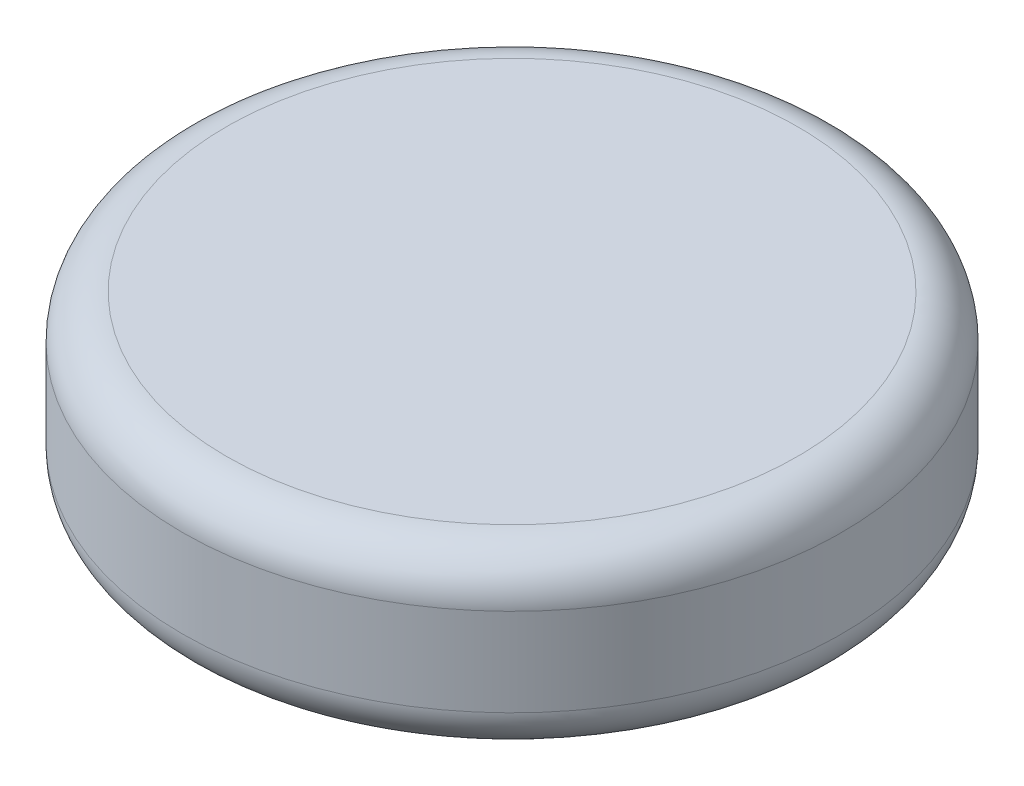
ISO-10303-21;
HEADER;
FILE_DESCRIPTION(('STEP AP214'),'2;1');
FILE_NAME('part.step','',(''),(''),'','','');
FILE_SCHEMA(('AUTOMOTIVE_DESIGN { 1 0 10303 214 1 1 1 1 }'));
ENDSEC;
DATA;
#1=APPLICATION_CONTEXT('core data for automotive mechanical design processes');
#2=APPLICATION_PROTOCOL_DEFINITION('international standard','automotive_design',2000,#1);
#3=PRODUCT_CONTEXT('',#1,'mechanical');
#4=PRODUCT('Part','Part','',(#3));
#5=PRODUCT_RELATED_PRODUCT_CATEGORY('part','',(#4));
#6=PRODUCT_DEFINITION_FORMATION('','',#4);
#7=PRODUCT_DEFINITION_CONTEXT('part definition',#1,'design');
#8=PRODUCT_DEFINITION('design','',#6,#7);
#9=PRODUCT_DEFINITION_SHAPE('','',#8);
#10=(LENGTH_UNIT() NAMED_UNIT(*) SI_UNIT(.MILLI.,.METRE.));
#11=(NAMED_UNIT(*) PLANE_ANGLE_UNIT() SI_UNIT($,.RADIAN.));
#12=(NAMED_UNIT(*) SI_UNIT($,.STERADIAN.) SOLID_ANGLE_UNIT());
#13=UNCERTAINTY_MEASURE_WITH_UNIT(LENGTH_MEASURE(1.E-05),#10,'distance_accuracy_value','');
#14=(GEOMETRIC_REPRESENTATION_CONTEXT(3) GLOBAL_UNCERTAINTY_ASSIGNED_CONTEXT((#13)) GLOBAL_UNIT_ASSIGNED_CONTEXT((#10,
#11,#12)) REPRESENTATION_CONTEXT('',''));
#15=CARTESIAN_POINT('',(0.,0.,0.));
#16=DIRECTION('',(0.,0.,1.));
#17=DIRECTION('',(1.,0.,0.));
#18=AXIS2_PLACEMENT_3D('',#15,#16,#17);
#19=CARTESIAN_POINT('',(0.,-1.2,0.));
#20=DIRECTION('',(0.,1.,0.));
#21=DIRECTION('',(0.,0.,1.));
#22=AXIS2_PLACEMENT_3D('',#19,#20,#21);
#23=PLANE('',#22);
#24=CARTESIAN_POINT('',(0.,-1.2,0.));
#25=DIRECTION('',(0.,1.,0.));
#26=DIRECTION('',(0.,0.,1.));
#27=AXIS2_PLACEMENT_3D('',#24,#25,#26);
#28=CIRCLE('',#27,6.3);
#29=CARTESIAN_POINT('',(0.,-1.2,6.3));
#30=VERTEX_POINT('',#29);
#31=EDGE_CURVE('E250',#30,#30,#28,.T.);
#32=ORIENTED_EDGE('',*,*,#31,.F.);
#33=EDGE_LOOP('',(#32));
#34=FACE_BOUND('',#33,.T.);
#35=DIRECTION('',(0.,0.,-1.));
#36=VECTOR('',#35,1.);
#37=CARTESIAN_POINT('',(-3.1,-1.2,0.));
#38=LINE('',#37,#36);
#39=CARTESIAN_POINT('',(-3.1,-1.2,3.1));
#40=VERTEX_POINT('',#39);
#41=CARTESIAN_POINT('',(-3.1,-1.2,-3.1));
#42=VERTEX_POINT('',#41);
#43=EDGE_CURVE('E260',#40,#42,#38,.T.);
#44=ORIENTED_EDGE('',*,*,#43,.F.);
#45=DIRECTION('',(-1.,0.,0.));
#46=VECTOR('',#45,1.);
#47=CARTESIAN_POINT('',(0.,-1.2,3.1));
#48=LINE('',#47,#46);
#49=CARTESIAN_POINT('',(3.1,-1.2,3.1));
#50=VERTEX_POINT('',#49);
#51=EDGE_CURVE('E253',#50,#40,#48,.T.);
#52=ORIENTED_EDGE('',*,*,#51,.F.);
#53=DIRECTION('',(0.,0.,-1.));
#54=VECTOR('',#53,1.);
#55=CARTESIAN_POINT('',(3.1,-1.2,0.));
#56=LINE('',#55,#54);
#57=CARTESIAN_POINT('',(3.1,-1.2,-3.1));
#58=VERTEX_POINT('',#57);
#59=EDGE_CURVE('E256',#50,#58,#56,.T.);
#60=ORIENTED_EDGE('',*,*,#59,.T.);
#61=DIRECTION('',(-1.,0.,0.));
#62=VECTOR('',#61,1.);
#63=CARTESIAN_POINT('',(0.,-1.2,-3.1));
#64=LINE('',#63,#62);
#65=EDGE_CURVE('E258',#58,#42,#64,.T.);
#66=ORIENTED_EDGE('',*,*,#65,.T.);
#67=EDGE_LOOP('',(#44,#52,#60,#66));
#68=FACE_BOUND('',#67,.T.);
#69=ADVANCED_FACE('F63',(#34,#68),#23,.F.);
#70=CARTESIAN_POINT('',(0.,-1.2,0.));
#71=DIRECTION('',(0.,1.,0.));
#72=DIRECTION('',(0.,0.,1.));
#73=AXIS2_PLACEMENT_3D('',#70,#71,#72);
#74=CYLINDRICAL_SURFACE('',#73,7.5);
#75=CARTESIAN_POINT('',(0.,-3.,0.));
#76=DIRECTION('',(0.,1.,0.));
#77=DIRECTION('',(0.,0.,1.));
#78=AXIS2_PLACEMENT_3D('',#75,#76,#77);
#79=CIRCLE('',#78,7.5);
#80=CARTESIAN_POINT('',(0.,-3.,7.5));
#81=VERTEX_POINT('',#80);
#82=EDGE_CURVE('E266',#81,#81,#79,.T.);
#83=ORIENTED_EDGE('',*,*,#82,.T.);
#84=EDGE_LOOP('',(#83));
#85=FACE_BOUND('',#84,.T.);
#86=CARTESIAN_POINT('',(0.,-1.,0.));
#87=DIRECTION('',(0.,1.,0.));
#88=DIRECTION('',(0.,0.,1.));
#89=AXIS2_PLACEMENT_3D('',#86,#87,#88);
#90=CIRCLE('',#89,7.5);
#91=CARTESIAN_POINT('',(0.,-1.,7.5));
#92=VERTEX_POINT('',#91);
#93=EDGE_CURVE('E263',#92,#92,#90,.F.);
#94=ORIENTED_EDGE('',*,*,#93,.T.);
#95=EDGE_LOOP('',(#94));
#96=FACE_BOUND('',#95,.T.);
#97=ADVANCED_FACE('F280',(#85,#96),#74,.T.);
#98=CARTESIAN_POINT('',(0.,0.,0.));
#99=DIRECTION('',(0.,1.,0.));
#100=DIRECTION('',(0.,0.,1.));
#101=AXIS2_PLACEMENT_3D('',#98,#99,#100);
#102=PLANE('',#101);
#103=CARTESIAN_POINT('',(0.,0.,0.));
#104=DIRECTION('',(0.,1.,0.));
#105=DIRECTION('',(0.,0.,1.));
#106=AXIS2_PLACEMENT_3D('',#103,#104,#105);
#107=CIRCLE('',#106,6.5);
#108=CARTESIAN_POINT('',(0.,0.,6.5));
#109=VERTEX_POINT('',#108);
#110=EDGE_CURVE('E12',#109,#109,#107,.T.);
#111=ORIENTED_EDGE('',*,*,#110,.T.);
#112=EDGE_LOOP('',(#111));
#113=FACE_BOUND('',#112,.T.);
#114=ADVANCED_FACE('F283',(#113),#102,.T.);
#115=CARTESIAN_POINT('',(0.,-4.,0.));
#116=DIRECTION('',(0.,1.,0.));
#117=DIRECTION('',(0.,0.,1.));
#118=AXIS2_PLACEMENT_3D('',#115,#116,#117);
#119=CYLINDRICAL_SURFACE('',#118,6.3);
#120=CARTESIAN_POINT('',(0.,-4.,0.));
#121=DIRECTION('',(0.,1.,0.));
#122=DIRECTION('',(0.,0.,1.));
#123=AXIS2_PLACEMENT_3D('',#120,#121,#122);
#124=CIRCLE('',#123,6.3);
#125=CARTESIAN_POINT('',(0.,-4.,6.3));
#126=VERTEX_POINT('',#125);
#127=EDGE_CURVE('E239',#126,#126,#124,.T.);
#128=ORIENTED_EDGE('',*,*,#127,.F.);
#129=EDGE_LOOP('',(#128));
#130=FACE_BOUND('',#129,.T.);
#131=ORIENTED_EDGE('',*,*,#31,.T.);
#132=EDGE_LOOP('',(#131));
#133=FACE_BOUND('',#132,.T.);
#134=ADVANCED_FACE('F292',(#130,#133),#119,.F.);
#135=CARTESIAN_POINT('',(0.,-4.,0.));
#136=DIRECTION('',(0.,1.,0.));
#137=DIRECTION('',(0.,0.,1.));
#138=AXIS2_PLACEMENT_3D('',#135,#136,#137);
#139=PLANE('',#138);
#140=CARTESIAN_POINT('',(0.,-4.,0.));
#141=DIRECTION('',(0.,1.,0.));
#142=DIRECTION('',(0.,0.,1.));
#143=AXIS2_PLACEMENT_3D('',#140,#141,#142);
#144=CIRCLE('',#143,6.5);
#145=CARTESIAN_POINT('',(0.,-4.,6.5));
#146=VERTEX_POINT('',#145);
#147=EDGE_CURVE('E71',#146,#146,#144,.F.);
#148=ORIENTED_EDGE('',*,*,#147,.T.);
#149=EDGE_LOOP('',(#148));
#150=FACE_BOUND('',#149,.T.);
#151=ORIENTED_EDGE('',*,*,#127,.T.);
#152=EDGE_LOOP('',(#151));
#153=FACE_BOUND('',#152,.T.);
#154=ADVANCED_FACE('F271',(#150,#153),#139,.F.);
#155=CARTESIAN_POINT('',(-3.1,-2.,0.));
#156=DIRECTION('',(1.,0.,0.));
#157=DIRECTION('',(0.,0.,-1.));
#158=AXIS2_PLACEMENT_3D('',#155,#156,#157);
#159=PLANE('',#158);
#160=DIRECTION('',(0.,1.,0.));
#161=VECTOR('',#160,1.);
#162=CARTESIAN_POINT('',(-3.1,-2.,3.1));
#163=LINE('',#162,#161);
#164=CARTESIAN_POINT('',(-3.1,-5.,3.1));
#165=VERTEX_POINT('',#164);
#166=EDGE_CURVE('E235',#165,#40,#163,.T.);
#167=ORIENTED_EDGE('',*,*,#166,.T.);
#168=ORIENTED_EDGE('',*,*,#43,.T.);
#169=DIRECTION('',(0.,1.,0.));
#170=VECTOR('',#169,1.);
#171=CARTESIAN_POINT('',(-3.1,-2.,-3.1));
#172=LINE('',#171,#170);
#173=CARTESIAN_POINT('',(-3.1,-5.,-3.1));
#174=VERTEX_POINT('',#173);
#175=EDGE_CURVE('E236',#174,#42,#172,.T.);
#176=ORIENTED_EDGE('',*,*,#175,.F.);
#177=DIRECTION('',(0.,0.,-1.));
#178=VECTOR('',#177,1.);
#179=CARTESIAN_POINT('',(-3.1,-5.,0.));
#180=LINE('',#179,#178);
#181=EDGE_CURVE('E226',#165,#174,#180,.T.);
#182=ORIENTED_EDGE('',*,*,#181,.F.);
#183=EDGE_LOOP('',(#167,#168,#176,#182));
#184=FACE_BOUND('',#183,.T.);
#185=ADVANCED_FACE('F309',(#184),#159,.F.);
#186=CARTESIAN_POINT('',(0.,-2.,-3.1));
#187=DIRECTION('',(0.,0.,-1.));
#188=DIRECTION('',(-1.,0.,0.));
#189=AXIS2_PLACEMENT_3D('',#186,#187,#188);
#190=PLANE('',#189);
#191=ORIENTED_EDGE('',*,*,#65,.F.);
#192=DIRECTION('',(0.,1.,0.));
#193=VECTOR('',#192,1.);
#194=CARTESIAN_POINT('',(3.1,-2.,-3.1));
#195=LINE('',#194,#193);
#196=CARTESIAN_POINT('',(3.1,-5.,-3.1));
#197=VERTEX_POINT('',#196);
#198=EDGE_CURVE('E240',#197,#58,#195,.T.);
#199=ORIENTED_EDGE('',*,*,#198,.F.);
#200=DIRECTION('',(-1.,0.,0.));
#201=VECTOR('',#200,1.);
#202=CARTESIAN_POINT('',(0.,-5.,-3.1));
#203=LINE('',#202,#201);
#204=EDGE_CURVE('E218',#197,#174,#203,.T.);
#205=ORIENTED_EDGE('',*,*,#204,.T.);
#206=ORIENTED_EDGE('',*,*,#175,.T.);
#207=EDGE_LOOP('',(#191,#199,#205,#206));
#208=FACE_BOUND('',#207,.T.);
#209=ADVANCED_FACE('F312',(#208),#190,.T.);
#210=CARTESIAN_POINT('',(3.1,-2.,0.));
#211=DIRECTION('',(1.,0.,0.));
#212=DIRECTION('',(0.,0.,-1.));
#213=AXIS2_PLACEMENT_3D('',#210,#211,#212);
#214=PLANE('',#213);
#215=ORIENTED_EDGE('',*,*,#59,.F.);
#216=DIRECTION('',(0.,1.,0.));
#217=VECTOR('',#216,1.);
#218=CARTESIAN_POINT('',(3.1,-2.,3.1));
#219=LINE('',#218,#217);
#220=CARTESIAN_POINT('',(3.1,-5.,3.1));
#221=VERTEX_POINT('',#220);
#222=EDGE_CURVE('E243',#221,#50,#219,.T.);
#223=ORIENTED_EDGE('',*,*,#222,.F.);
#224=DIRECTION('',(0.,0.,-1.));
#225=VECTOR('',#224,1.);
#226=CARTESIAN_POINT('',(3.1,-5.,0.));
#227=LINE('',#226,#225);
#228=EDGE_CURVE('E232',#221,#197,#227,.T.);
#229=ORIENTED_EDGE('',*,*,#228,.T.);
#230=ORIENTED_EDGE('',*,*,#198,.T.);
#231=EDGE_LOOP('',(#215,#223,#229,#230));
#232=FACE_BOUND('',#231,.T.);
#233=ADVANCED_FACE('F317',(#232),#214,.T.);
#234=CARTESIAN_POINT('',(0.,-2.,3.1));
#235=DIRECTION('',(0.,0.,-1.));
#236=DIRECTION('',(-1.,0.,0.));
#237=AXIS2_PLACEMENT_3D('',#234,#235,#236);
#238=PLANE('',#237);
#239=ORIENTED_EDGE('',*,*,#222,.T.);
#240=ORIENTED_EDGE('',*,*,#51,.T.);
#241=ORIENTED_EDGE('',*,*,#166,.F.);
#242=DIRECTION('',(-1.,0.,0.));
#243=VECTOR('',#242,1.);
#244=CARTESIAN_POINT('',(0.,-5.,3.1));
#245=LINE('',#244,#243);
#246=EDGE_CURVE('E229',#221,#165,#245,.T.);
#247=ORIENTED_EDGE('',*,*,#246,.F.);
#248=EDGE_LOOP('',(#239,#240,#241,#247));
#249=FACE_BOUND('',#248,.T.);
#250=ADVANCED_FACE('F314',(#249),#238,.F.);
#251=CARTESIAN_POINT('',(0.,-5.,0.));
#252=DIRECTION('',(0.,-1.,0.));
#253=DIRECTION('',(0.,0.,-1.));
#254=AXIS2_PLACEMENT_3D('',#251,#252,#253);
#255=PLANE('',#254);
#256=ORIENTED_EDGE('',*,*,#204,.F.);
#257=ORIENTED_EDGE('',*,*,#228,.F.);
#258=ORIENTED_EDGE('',*,*,#246,.T.);
#259=ORIENTED_EDGE('',*,*,#181,.T.);
#260=EDGE_LOOP('',(#256,#257,#258,#259));
#261=FACE_BOUND('',#260,.T.);
#262=DIRECTION('',(0.,0.,-1.));
#263=VECTOR('',#262,1.);
#264=CARTESIAN_POINT('',(-1.7,-5.,-1.7));
#265=LINE('',#264,#263);
#266=CARTESIAN_POINT('',(-1.7,-5.,1.7));
#267=VERTEX_POINT('',#266);
#268=CARTESIAN_POINT('',(-1.7,-5.,-1.7));
#269=VERTEX_POINT('',#268);
#270=EDGE_CURVE('E160',#267,#269,#265,.T.);
#271=ORIENTED_EDGE('',*,*,#270,.F.);
#272=DIRECTION('',(-1.,0.,0.));
#273=VECTOR('',#272,1.);
#274=CARTESIAN_POINT('',(1.7,-5.,1.7));
#275=LINE('',#274,#273);
#276=CARTESIAN_POINT('',(1.7,-5.,1.7));
#277=VERTEX_POINT('',#276);
#278=EDGE_CURVE('E178',#277,#267,#275,.T.);
#279=ORIENTED_EDGE('',*,*,#278,.F.);
#280=DIRECTION('',(0.,0.,1.));
#281=VECTOR('',#280,1.);
#282=CARTESIAN_POINT('',(1.7,-5.,-1.7));
#283=LINE('',#282,#281);
#284=CARTESIAN_POINT('',(1.7,-5.,-1.7));
#285=VERTEX_POINT('',#284);
#286=EDGE_CURVE('E181',#285,#277,#283,.T.);
#287=ORIENTED_EDGE('',*,*,#286,.F.);
#288=DIRECTION('',(1.,0.,0.));
#289=VECTOR('',#288,1.);
#290=CARTESIAN_POINT('',(1.7,-5.,-1.7));
#291=LINE('',#290,#289);
#292=EDGE_CURVE('E187',#269,#285,#291,.T.);
#293=ORIENTED_EDGE('',*,*,#292,.F.);
#294=EDGE_LOOP('',(#271,#279,#287,#293));
#295=FACE_BOUND('',#294,.T.);
#296=ADVANCED_FACE('F277',(#261,#295),#255,.T.);
#297=CARTESIAN_POINT('',(0.,-3.,0.));
#298=DIRECTION('',(0.,1.,0.));
#299=DIRECTION('',(0.,0.,1.));
#300=AXIS2_PLACEMENT_3D('',#297,#298,#299);
#301=TOROIDAL_SURFACE('',#300,6.5,1.);
#302=ORIENTED_EDGE('',*,*,#147,.F.);
#303=EDGE_LOOP('',(#302));
#304=FACE_BOUND('',#303,.T.);
#305=ORIENTED_EDGE('',*,*,#82,.F.);
#306=EDGE_LOOP('',(#305));
#307=FACE_BOUND('',#306,.T.);
#308=ADVANCED_FACE('F274',(#304,#307),#301,.T.);
#309=CARTESIAN_POINT('',(0.,-1.,0.));
#310=DIRECTION('',(0.,1.,0.));
#311=DIRECTION('',(0.,0.,1.));
#312=AXIS2_PLACEMENT_3D('',#309,#310,#311);
#313=TOROIDAL_SURFACE('',#312,6.5,1.);
#314=ORIENTED_EDGE('',*,*,#93,.F.);
#315=EDGE_LOOP('',(#314));
#316=FACE_BOUND('',#315,.T.);
#317=ORIENTED_EDGE('',*,*,#110,.F.);
#318=EDGE_LOOP('',(#317));
#319=FACE_BOUND('',#318,.T.);
#320=ADVANCED_FACE('F65',(#316,#319),#313,.T.);
#321=CARTESIAN_POINT('',(0.,-4.2,0.));
#322=DIRECTION('',(0.,-1.,0.));
#323=DIRECTION('',(0.,0.,-1.));
#324=AXIS2_PLACEMENT_3D('',#321,#322,#323);
#325=PLANE('',#324);
#326=DIRECTION('',(-1.,0.,0.));
#327=VECTOR('',#326,1.);
#328=CARTESIAN_POINT('',(1.7,-4.2,1.7));
#329=LINE('',#328,#327);
#330=CARTESIAN_POINT('',(1.7,-4.2,1.7));
#331=VERTEX_POINT('',#330);
#332=CARTESIAN_POINT('',(-1.7,-4.2,1.7));
#333=VERTEX_POINT('',#332);
#334=EDGE_CURVE('E165',#331,#333,#329,.T.);
#335=ORIENTED_EDGE('',*,*,#334,.T.);
#336=DIRECTION('',(0.,0.,-1.));
#337=VECTOR('',#336,1.);
#338=CARTESIAN_POINT('',(-1.7,-4.2,-1.7));
#339=LINE('',#338,#337);
#340=CARTESIAN_POINT('',(-1.7,-4.2,-1.7));
#341=VERTEX_POINT('',#340);
#342=EDGE_CURVE('E157',#333,#341,#339,.T.);
#343=ORIENTED_EDGE('',*,*,#342,.T.);
#344=DIRECTION('',(1.,0.,0.));
#345=VECTOR('',#344,1.);
#346=CARTESIAN_POINT('',(1.7,-4.2,-1.7));
#347=LINE('',#346,#345);
#348=CARTESIAN_POINT('',(1.7,-4.2,-1.7));
#349=VERTEX_POINT('',#348);
#350=EDGE_CURVE('E169',#341,#349,#347,.T.);
#351=ORIENTED_EDGE('',*,*,#350,.T.);
#352=DIRECTION('',(0.,0.,1.));
#353=VECTOR('',#352,1.);
#354=CARTESIAN_POINT('',(1.7,-4.2,-1.7));
#355=LINE('',#354,#353);
#356=EDGE_CURVE('E173',#349,#331,#355,.T.);
#357=ORIENTED_EDGE('',*,*,#356,.T.);
#358=EDGE_LOOP('',(#335,#343,#351,#357));
#359=FACE_BOUND('',#358,.T.);
#360=DIRECTION('',(0.,0.,-1.));
#361=VECTOR('',#360,1.);
#362=CARTESIAN_POINT('',(-1.9,-4.2,-1.9));
#363=LINE('',#362,#361);
#364=CARTESIAN_POINT('',(-1.9,-4.2,1.9));
#365=VERTEX_POINT('',#364);
#366=CARTESIAN_POINT('',(-1.9,-4.2,-1.9));
#367=VERTEX_POINT('',#366);
#368=EDGE_CURVE('E193',#365,#367,#363,.T.);
#369=ORIENTED_EDGE('',*,*,#368,.F.);
#370=DIRECTION('',(-1.,0.,0.));
#371=VECTOR('',#370,1.);
#372=CARTESIAN_POINT('',(1.9,-4.2,1.9));
#373=LINE('',#372,#371);
#374=CARTESIAN_POINT('',(1.9,-4.2,1.9));
#375=VERTEX_POINT('',#374);
#376=EDGE_CURVE('E85',#375,#365,#373,.T.);
#377=ORIENTED_EDGE('',*,*,#376,.F.);
#378=DIRECTION('',(0.,0.,1.));
#379=VECTOR('',#378,1.);
#380=CARTESIAN_POINT('',(1.9,-4.2,-1.9));
#381=LINE('',#380,#379);
#382=CARTESIAN_POINT('',(1.9,-4.2,-1.9));
#383=VERTEX_POINT('',#382);
#384=EDGE_CURVE('E78',#383,#375,#381,.T.);
#385=ORIENTED_EDGE('',*,*,#384,.F.);
#386=DIRECTION('',(1.,0.,0.));
#387=VECTOR('',#386,1.);
#388=CARTESIAN_POINT('',(1.9,-4.2,-1.9));
#389=LINE('',#388,#387);
#390=EDGE_CURVE('E199',#367,#383,#389,.T.);
#391=ORIENTED_EDGE('',*,*,#390,.F.);
#392=EDGE_LOOP('',(#369,#377,#385,#391));
#393=FACE_BOUND('',#392,.T.);
#394=ADVANCED_FACE('F175',(#359,#393),#325,.F.);
#395=CARTESIAN_POINT('',(-1.7,-4.2,-1.7));
#396=DIRECTION('',(-1.,0.,0.));
#397=DIRECTION('',(0.,0.,1.));
#398=AXIS2_PLACEMENT_3D('',#395,#396,#397);
#399=PLANE('',#398);
#400=ORIENTED_EDGE('',*,*,#270,.T.);
#401=DIRECTION('',(0.,-1.,0.));
#402=VECTOR('',#401,1.);
#403=CARTESIAN_POINT('',(-1.7,-4.2,-1.7));
#404=LINE('',#403,#402);
#405=EDGE_CURVE('E153',#341,#269,#404,.T.);
#406=ORIENTED_EDGE('',*,*,#405,.F.);
#407=ORIENTED_EDGE('',*,*,#342,.F.);
#408=DIRECTION('',(0.,-1.,0.));
#409=VECTOR('',#408,1.);
#410=CARTESIAN_POINT('',(-1.7,-4.2,1.7));
#411=LINE('',#410,#409);
#412=EDGE_CURVE('E191',#333,#267,#411,.T.);
#413=ORIENTED_EDGE('',*,*,#412,.T.);
#414=EDGE_LOOP('',(#400,#406,#407,#413));
#415=FACE_BOUND('',#414,.T.);
#416=ADVANCED_FACE('F155',(#415),#399,.F.);
#417=CARTESIAN_POINT('',(1.7,-4.2,1.7));
#418=DIRECTION('',(0.,0.,1.));
#419=DIRECTION('',(1.,0.,0.));
#420=AXIS2_PLACEMENT_3D('',#417,#418,#419);
#421=PLANE('',#420);
#422=ORIENTED_EDGE('',*,*,#278,.T.);
#423=ORIENTED_EDGE('',*,*,#412,.F.);
#424=ORIENTED_EDGE('',*,*,#334,.F.);
#425=DIRECTION('',(0.,-1.,0.));
#426=VECTOR('',#425,1.);
#427=CARTESIAN_POINT('',(1.7,-4.2,1.7));
#428=LINE('',#427,#426);
#429=EDGE_CURVE('E194',#331,#277,#428,.T.);
#430=ORIENTED_EDGE('',*,*,#429,.T.);
#431=EDGE_LOOP('',(#422,#423,#424,#430));
#432=FACE_BOUND('',#431,.T.);
#433=ADVANCED_FACE('F350',(#432),#421,.F.);
#434=CARTESIAN_POINT('',(1.7,-4.2,-1.7));
#435=DIRECTION('',(1.,0.,0.));
#436=DIRECTION('',(0.,0.,-1.));
#437=AXIS2_PLACEMENT_3D('',#434,#435,#436);
#438=PLANE('',#437);
#439=ORIENTED_EDGE('',*,*,#286,.T.);
#440=ORIENTED_EDGE('',*,*,#429,.F.);
#441=ORIENTED_EDGE('',*,*,#356,.F.);
#442=DIRECTION('',(0.,-1.,0.));
#443=VECTOR('',#442,1.);
#444=CARTESIAN_POINT('',(1.7,-4.2,-1.7));
#445=LINE('',#444,#443);
#446=EDGE_CURVE('E164',#349,#285,#445,.T.);
#447=ORIENTED_EDGE('',*,*,#446,.T.);
#448=EDGE_LOOP('',(#439,#440,#441,#447));
#449=FACE_BOUND('',#448,.T.);
#450=ADVANCED_FACE('F353',(#449),#438,.F.);
#451=CARTESIAN_POINT('',(1.7,-4.2,-1.7));
#452=DIRECTION('',(0.,0.,-1.));
#453=DIRECTION('',(-1.,0.,0.));
#454=AXIS2_PLACEMENT_3D('',#451,#452,#453);
#455=PLANE('',#454);
#456=ORIENTED_EDGE('',*,*,#292,.T.);
#457=ORIENTED_EDGE('',*,*,#446,.F.);
#458=ORIENTED_EDGE('',*,*,#350,.F.);
#459=ORIENTED_EDGE('',*,*,#405,.T.);
#460=EDGE_LOOP('',(#456,#457,#458,#459));
#461=FACE_BOUND('',#460,.T.);
#462=ADVANCED_FACE('F170',(#461),#455,.F.);
#463=CARTESIAN_POINT('',(0.,-2.,0.));
#464=DIRECTION('',(0.,1.,0.));
#465=DIRECTION('',(0.,0.,1.));
#466=AXIS2_PLACEMENT_3D('',#463,#464,#465);
#467=PLANE('',#466);
#468=DIRECTION('',(0.,0.,-1.));
#469=VECTOR('',#468,1.);
#470=CARTESIAN_POINT('',(1.9,-2.,0.));
#471=LINE('',#470,#469);
#472=CARTESIAN_POINT('',(1.9,-2.,1.9));
#473=VERTEX_POINT('',#472);
#474=CARTESIAN_POINT('',(1.9,-2.,-1.9));
#475=VERTEX_POINT('',#474);
#476=EDGE_CURVE('E203',#473,#475,#471,.T.);
#477=ORIENTED_EDGE('',*,*,#476,.F.);
#478=DIRECTION('',(-1.,0.,0.));
#479=VECTOR('',#478,1.);
#480=CARTESIAN_POINT('',(0.,-2.,1.9));
#481=LINE('',#480,#479);
#482=CARTESIAN_POINT('',(-1.9,-2.,1.9));
#483=VERTEX_POINT('',#482);
#484=EDGE_CURVE('E212',#473,#483,#481,.T.);
#485=ORIENTED_EDGE('',*,*,#484,.T.);
#486=DIRECTION('',(0.,0.,-1.));
#487=VECTOR('',#486,1.);
#488=CARTESIAN_POINT('',(-1.9,-2.,0.));
#489=LINE('',#488,#487);
#490=CARTESIAN_POINT('',(-1.9,-2.,-1.9));
#491=VERTEX_POINT('',#490);
#492=EDGE_CURVE('E209',#483,#491,#489,.T.);
#493=ORIENTED_EDGE('',*,*,#492,.T.);
#494=DIRECTION('',(-1.,0.,0.));
#495=VECTOR('',#494,1.);
#496=CARTESIAN_POINT('',(0.,-2.,-1.9));
#497=LINE('',#496,#495);
#498=EDGE_CURVE('E206',#475,#491,#497,.T.);
#499=ORIENTED_EDGE('',*,*,#498,.F.);
#500=EDGE_LOOP('',(#477,#485,#493,#499));
#501=FACE_BOUND('',#500,.T.);
#502=ADVANCED_FACE('F325',(#501),#467,.F.);
#503=CARTESIAN_POINT('',(0.,-5.,-1.9));
#504=DIRECTION('',(0.,0.,-1.));
#505=DIRECTION('',(-1.,0.,0.));
#506=AXIS2_PLACEMENT_3D('',#503,#504,#505);
#507=PLANE('',#506);
#508=ORIENTED_EDGE('',*,*,#390,.T.);
#509=DIRECTION('',(0.,1.,0.));
#510=VECTOR('',#509,1.);
#511=CARTESIAN_POINT('',(1.9,-5.,-1.9));
#512=LINE('',#511,#510);
#513=EDGE_CURVE('E215',#383,#475,#512,.T.);
#514=ORIENTED_EDGE('',*,*,#513,.T.);
#515=ORIENTED_EDGE('',*,*,#498,.T.);
#516=DIRECTION('',(0.,1.,0.));
#517=VECTOR('',#516,1.);
#518=CARTESIAN_POINT('',(-1.9,-5.,-1.9));
#519=LINE('',#518,#517);
#520=EDGE_CURVE('E221',#367,#491,#519,.T.);
#521=ORIENTED_EDGE('',*,*,#520,.F.);
#522=EDGE_LOOP('',(#508,#514,#515,#521));
#523=FACE_BOUND('',#522,.T.);
#524=ADVANCED_FACE('F328',(#523),#507,.F.);
#525=CARTESIAN_POINT('',(-1.9,-5.,0.));
#526=DIRECTION('',(1.,0.,0.));
#527=DIRECTION('',(0.,0.,-1.));
#528=AXIS2_PLACEMENT_3D('',#525,#526,#527);
#529=PLANE('',#528);
#530=DIRECTION('',(0.,1.,0.));
#531=VECTOR('',#530,1.);
#532=CARTESIAN_POINT('',(-1.9,-5.,1.9));
#533=LINE('',#532,#531);
#534=EDGE_CURVE('E219',#365,#483,#533,.T.);
#535=ORIENTED_EDGE('',*,*,#534,.F.);
#536=ORIENTED_EDGE('',*,*,#368,.T.);
#537=ORIENTED_EDGE('',*,*,#520,.T.);
#538=ORIENTED_EDGE('',*,*,#492,.F.);
#539=EDGE_LOOP('',(#535,#536,#537,#538));
#540=FACE_BOUND('',#539,.T.);
#541=ADVANCED_FACE('F339',(#540),#529,.T.);
#542=CARTESIAN_POINT('',(0.,-5.,1.9));
#543=DIRECTION('',(0.,0.,-1.));
#544=DIRECTION('',(-1.,0.,0.));
#545=AXIS2_PLACEMENT_3D('',#542,#543,#544);
#546=PLANE('',#545);
#547=DIRECTION('',(0.,1.,0.));
#548=VECTOR('',#547,1.);
#549=CARTESIAN_POINT('',(1.9,-5.,1.9));
#550=LINE('',#549,#548);
#551=EDGE_CURVE('E216',#375,#473,#550,.T.);
#552=ORIENTED_EDGE('',*,*,#551,.F.);
#553=ORIENTED_EDGE('',*,*,#376,.T.);
#554=ORIENTED_EDGE('',*,*,#534,.T.);
#555=ORIENTED_EDGE('',*,*,#484,.F.);
#556=EDGE_LOOP('',(#552,#553,#554,#555));
#557=FACE_BOUND('',#556,.T.);
#558=ADVANCED_FACE('F336',(#557),#546,.T.);
#559=CARTESIAN_POINT('',(1.9,-5.,0.));
#560=DIRECTION('',(1.,0.,0.));
#561=DIRECTION('',(0.,0.,-1.));
#562=AXIS2_PLACEMENT_3D('',#559,#560,#561);
#563=PLANE('',#562);
#564=ORIENTED_EDGE('',*,*,#384,.T.);
#565=ORIENTED_EDGE('',*,*,#551,.T.);
#566=ORIENTED_EDGE('',*,*,#476,.T.);
#567=ORIENTED_EDGE('',*,*,#513,.F.);
#568=EDGE_LOOP('',(#564,#565,#566,#567));
#569=FACE_BOUND('',#568,.T.);
#570=ADVANCED_FACE('F333',(#569),#563,.F.);
#571=CLOSED_SHELL('',(#69,#97,#114,#134,#154,#185,#209,#233,#250,#296,#308,#320,#394,#416,#433,
#450,#462,#502,#524,#541,#558,#570));
#572=MANIFOLD_SOLID_BREP('B2',#571);
#573=ADVANCED_BREP_SHAPE_REPRESENTATION('',(#18,#572),#14);
#574=SHAPE_DEFINITION_REPRESENTATION(#9,#573);
ENDSEC;
END-ISO-10303-21;
